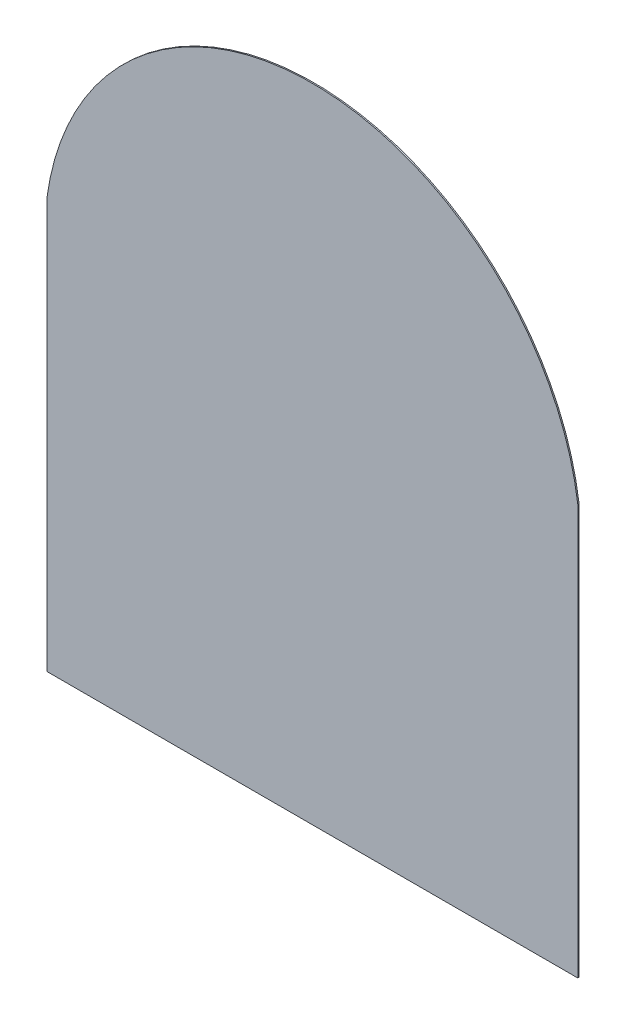
ISO-10303-21;
HEADER;
FILE_DESCRIPTION(('STEP AP214'),'2;1');
FILE_NAME('part.step','',(''),(''),'','','');
FILE_SCHEMA(('AUTOMOTIVE_DESIGN { 1 0 10303 214 1 1 1 1 }'));
ENDSEC;
DATA;
#1=APPLICATION_CONTEXT('core data for automotive mechanical design processes');
#2=APPLICATION_PROTOCOL_DEFINITION('international standard','automotive_design',2000,#1);
#3=PRODUCT_CONTEXT('',#1,'mechanical');
#4=PRODUCT('Part','Part','',(#3));
#5=PRODUCT_RELATED_PRODUCT_CATEGORY('part','',(#4));
#6=PRODUCT_DEFINITION_FORMATION('','',#4);
#7=PRODUCT_DEFINITION_CONTEXT('part definition',#1,'design');
#8=PRODUCT_DEFINITION('design','',#6,#7);
#9=PRODUCT_DEFINITION_SHAPE('','',#8);
#10=(LENGTH_UNIT() NAMED_UNIT(*) SI_UNIT(.MILLI.,.METRE.));
#11=(NAMED_UNIT(*) PLANE_ANGLE_UNIT() SI_UNIT($,.RADIAN.));
#12=(NAMED_UNIT(*) SI_UNIT($,.STERADIAN.) SOLID_ANGLE_UNIT());
#13=UNCERTAINTY_MEASURE_WITH_UNIT(LENGTH_MEASURE(1.E-05),#10,'distance_accuracy_value','');
#14=(GEOMETRIC_REPRESENTATION_CONTEXT(3) GLOBAL_UNCERTAINTY_ASSIGNED_CONTEXT((#13)) GLOBAL_UNIT_ASSIGNED_CONTEXT((#10,
#11,#12)) REPRESENTATION_CONTEXT('',''));
#15=CARTESIAN_POINT('',(0.,0.,0.));
#16=DIRECTION('',(0.,0.,1.));
#17=DIRECTION('',(1.,0.,0.));
#18=AXIS2_PLACEMENT_3D('',#15,#16,#17);
#19=CARTESIAN_POINT('',(-1030.,796.000000000001,2.5));
#20=DIRECTION('',(1.,0.,0.));
#21=DIRECTION('',(0.,0.,-1.));
#22=AXIS2_PLACEMENT_3D('',#19,#20,#21);
#23=PLANE('',#22);
#24=DIRECTION('',(0.,-1.,0.));
#25=VECTOR('',#24,1.);
#26=CARTESIAN_POINT('',(-1030.,796.000000000001,-2.5));
#27=LINE('',#26,#25);
#28=CARTESIAN_POINT('',(-1030.,796.000000000001,-2.5));
#29=VERTEX_POINT('',#28);
#30=CARTESIAN_POINT('',(-1030.,-795.999999999998,-2.5));
#31=VERTEX_POINT('',#30);
#32=EDGE_CURVE('E107',#29,#31,#27,.T.);
#33=ORIENTED_EDGE('',*,*,#32,.T.);
#34=DIRECTION('',(0.,0.,-1.));
#35=VECTOR('',#34,1.);
#36=CARTESIAN_POINT('',(-1030.,-795.999999999998,2.5));
#37=LINE('',#36,#35);
#38=CARTESIAN_POINT('',(-1030.,-795.999999999998,2.5));
#39=VERTEX_POINT('',#38);
#40=EDGE_CURVE('E11',#39,#31,#37,.T.);
#41=ORIENTED_EDGE('',*,*,#40,.F.);
#42=DIRECTION('',(0.,-1.,0.));
#43=VECTOR('',#42,1.);
#44=CARTESIAN_POINT('',(-1030.,796.000000000001,2.5));
#45=LINE('',#44,#43);
#46=CARTESIAN_POINT('',(-1030.,796.000000000001,2.5));
#47=VERTEX_POINT('',#46);
#48=EDGE_CURVE('E91',#47,#39,#45,.T.);
#49=ORIENTED_EDGE('',*,*,#48,.F.);
#50=DIRECTION('',(0.,0.,-1.));
#51=VECTOR('',#50,1.);
#52=CARTESIAN_POINT('',(-1030.,796.000000000001,2.5));
#53=LINE('',#52,#51);
#54=EDGE_CURVE('E103',#47,#29,#53,.T.);
#55=ORIENTED_EDGE('',*,*,#54,.T.);
#56=EDGE_LOOP('',(#33,#41,#49,#55));
#57=FACE_BOUND('',#56,.T.);
#58=ADVANCED_FACE('F39',(#57),#23,.F.);
#59=CARTESIAN_POINT('',(1030.,-795.999999999998,2.5));
#60=DIRECTION('',(0.,1.,0.));
#61=DIRECTION('',(0.,0.,1.));
#62=AXIS2_PLACEMENT_3D('',#59,#60,#61);
#63=PLANE('',#62);
#64=DIRECTION('',(1.,0.,0.));
#65=VECTOR('',#64,1.);
#66=CARTESIAN_POINT('',(1030.,-795.999999999998,-2.5));
#67=LINE('',#66,#65);
#68=CARTESIAN_POINT('',(1030.,-795.999999999998,-2.5));
#69=VERTEX_POINT('',#68);
#70=EDGE_CURVE('E96',#31,#69,#67,.T.);
#71=ORIENTED_EDGE('',*,*,#70,.T.);
#72=DIRECTION('',(0.,0.,-1.));
#73=VECTOR('',#72,1.);
#74=CARTESIAN_POINT('',(1030.,-795.999999999998,2.5));
#75=LINE('',#74,#73);
#76=CARTESIAN_POINT('',(1030.,-795.999999999998,2.5));
#77=VERTEX_POINT('',#76);
#78=EDGE_CURVE('E48',#77,#69,#75,.T.);
#79=ORIENTED_EDGE('',*,*,#78,.F.);
#80=DIRECTION('',(1.,0.,0.));
#81=VECTOR('',#80,1.);
#82=CARTESIAN_POINT('',(1030.,-795.999999999998,2.5));
#83=LINE('',#82,#81);
#84=EDGE_CURVE('E86',#39,#77,#83,.T.);
#85=ORIENTED_EDGE('',*,*,#84,.F.);
#86=ORIENTED_EDGE('',*,*,#40,.T.);
#87=EDGE_LOOP('',(#71,#79,#85,#86));
#88=FACE_BOUND('',#87,.T.);
#89=ADVANCED_FACE('F95',(#88),#63,.F.);
#90=CARTESIAN_POINT('',(1030.,796.000000000001,2.5));
#91=DIRECTION('',(-1.,0.,0.));
#92=DIRECTION('',(0.,-1.,0.));
#93=AXIS2_PLACEMENT_3D('',#90,#91,#92);
#94=PLANE('',#93);
#95=DIRECTION('',(0.,1.,0.));
#96=VECTOR('',#95,1.);
#97=CARTESIAN_POINT('',(1030.,796.000000000001,-2.5));
#98=LINE('',#97,#96);
#99=CARTESIAN_POINT('',(1030.,796.000000000001,-2.5));
#100=VERTEX_POINT('',#99);
#101=EDGE_CURVE('E73',#69,#100,#98,.T.);
#102=ORIENTED_EDGE('',*,*,#101,.T.);
#103=DIRECTION('',(0.,0.,-1.));
#104=VECTOR('',#103,1.);
#105=CARTESIAN_POINT('',(1030.,796.000000000001,2.5));
#106=LINE('',#105,#104);
#107=CARTESIAN_POINT('',(1030.,796.000000000001,2.5));
#108=VERTEX_POINT('',#107);
#109=EDGE_CURVE('E98',#108,#100,#106,.T.);
#110=ORIENTED_EDGE('',*,*,#109,.F.);
#111=DIRECTION('',(0.,1.,0.));
#112=VECTOR('',#111,1.);
#113=CARTESIAN_POINT('',(1030.,796.000000000001,2.5));
#114=LINE('',#113,#112);
#115=EDGE_CURVE('E89',#77,#108,#114,.T.);
#116=ORIENTED_EDGE('',*,*,#115,.F.);
#117=ORIENTED_EDGE('',*,*,#78,.T.);
#118=EDGE_LOOP('',(#102,#110,#116,#117));
#119=FACE_BOUND('',#118,.T.);
#120=ADVANCED_FACE('F99',(#119),#94,.F.);
#121=CARTESIAN_POINT('',(0.,656.61111111111,2.5));
#122=DIRECTION('',(0.,0.,-1.));
#123=DIRECTION('',(-1.,0.,0.));
#124=AXIS2_PLACEMENT_3D('',#121,#122,#123);
#125=CYLINDRICAL_SURFACE('',#124,1039.38888888889);
#126=CARTESIAN_POINT('',(0.,656.61111111111,-2.5));
#127=DIRECTION('',(0.,0.,1.));
#128=DIRECTION('',(-1.,0.,0.));
#129=AXIS2_PLACEMENT_3D('',#126,#127,#128);
#130=CIRCLE('',#129,1039.38888888889);
#131=EDGE_CURVE('E79',#100,#29,#130,.T.);
#132=ORIENTED_EDGE('',*,*,#131,.T.);
#133=ORIENTED_EDGE('',*,*,#54,.F.);
#134=CARTESIAN_POINT('',(0.,656.61111111111,2.5));
#135=DIRECTION('',(0.,0.,1.));
#136=DIRECTION('',(-1.,0.,0.));
#137=AXIS2_PLACEMENT_3D('',#134,#135,#136);
#138=CIRCLE('',#137,1039.38888888889);
#139=EDGE_CURVE('E56',#108,#47,#138,.T.);
#140=ORIENTED_EDGE('',*,*,#139,.F.);
#141=ORIENTED_EDGE('',*,*,#109,.T.);
#142=EDGE_LOOP('',(#132,#133,#140,#141));
#143=FACE_BOUND('',#142,.T.);
#144=ADVANCED_FACE('F120',(#143),#125,.T.);
#145=CARTESIAN_POINT('',(0.,656.61111111111,2.5));
#146=DIRECTION('',(0.,0.,-1.));
#147=DIRECTION('',(-1.,0.,0.));
#148=AXIS2_PLACEMENT_3D('',#145,#146,#147);
#149=PLANE('',#148);
#150=ORIENTED_EDGE('',*,*,#48,.T.);
#151=ORIENTED_EDGE('',*,*,#84,.T.);
#152=ORIENTED_EDGE('',*,*,#115,.T.);
#153=ORIENTED_EDGE('',*,*,#139,.T.);
#154=EDGE_LOOP('',(#150,#151,#152,#153));
#155=FACE_BOUND('',#154,.T.);
#156=ADVANCED_FACE('F87',(#155),#149,.F.);
#157=CARTESIAN_POINT('',(0.,656.61111111111,-2.5));
#158=DIRECTION('',(0.,0.,-1.));
#159=DIRECTION('',(-1.,0.,0.));
#160=AXIS2_PLACEMENT_3D('',#157,#158,#159);
#161=PLANE('',#160);
#162=ORIENTED_EDGE('',*,*,#32,.F.);
#163=ORIENTED_EDGE('',*,*,#131,.F.);
#164=ORIENTED_EDGE('',*,*,#101,.F.);
#165=ORIENTED_EDGE('',*,*,#70,.F.);
#166=EDGE_LOOP('',(#162,#163,#164,#165));
#167=FACE_BOUND('',#166,.T.);
#168=ADVANCED_FACE('F123',(#167),#161,.T.);
#169=CLOSED_SHELL('',(#58,#89,#120,#144,#156,#168));
#170=MANIFOLD_SOLID_BREP('B2',#169);
#171=ADVANCED_BREP_SHAPE_REPRESENTATION('',(#18,#170),#14);
#172=SHAPE_DEFINITION_REPRESENTATION(#9,#171);
ENDSEC;
END-ISO-10303-21;
